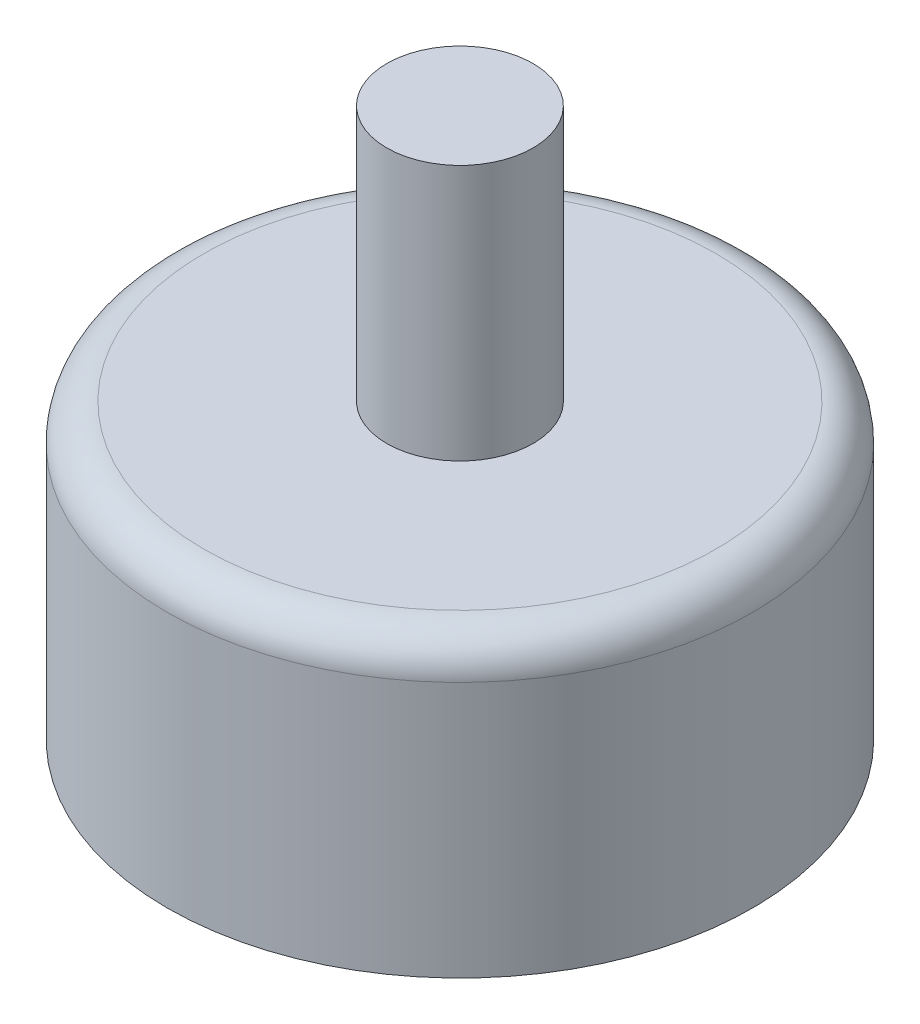
ISO-10303-21;
HEADER;
FILE_DESCRIPTION(('STEP AP214'),'2;1');
FILE_NAME('part.step','',(''),(''),'','','');
FILE_SCHEMA(('AUTOMOTIVE_DESIGN { 1 0 10303 214 1 1 1 1 }'));
ENDSEC;
DATA;
#1=APPLICATION_CONTEXT('core data for automotive mechanical design processes');
#2=APPLICATION_PROTOCOL_DEFINITION('international standard','automotive_design',2000,#1);
#3=PRODUCT_CONTEXT('',#1,'mechanical');
#4=PRODUCT('Part','Part','',(#3));
#5=PRODUCT_RELATED_PRODUCT_CATEGORY('part','',(#4));
#6=PRODUCT_DEFINITION_FORMATION('','',#4);
#7=PRODUCT_DEFINITION_CONTEXT('part definition',#1,'design');
#8=PRODUCT_DEFINITION('design','',#6,#7);
#9=PRODUCT_DEFINITION_SHAPE('','',#8);
#10=(LENGTH_UNIT() NAMED_UNIT(*) SI_UNIT(.MILLI.,.METRE.));
#11=(NAMED_UNIT(*) PLANE_ANGLE_UNIT() SI_UNIT($,.RADIAN.));
#12=(NAMED_UNIT(*) SI_UNIT($,.STERADIAN.) SOLID_ANGLE_UNIT());
#13=UNCERTAINTY_MEASURE_WITH_UNIT(LENGTH_MEASURE(1.E-05),#10,'distance_accuracy_value','');
#14=(GEOMETRIC_REPRESENTATION_CONTEXT(3) GLOBAL_UNCERTAINTY_ASSIGNED_CONTEXT((#13)) GLOBAL_UNIT_ASSIGNED_CONTEXT((#10,
#11,#12)) REPRESENTATION_CONTEXT('',''));
#15=CARTESIAN_POINT('',(0.,0.,0.));
#16=DIRECTION('',(0.,0.,1.));
#17=DIRECTION('',(1.,0.,0.));
#18=AXIS2_PLACEMENT_3D('',#15,#16,#17);
#19=CARTESIAN_POINT('',(0.,20.,0.));
#20=DIRECTION('',(0.,-1.,0.));
#21=DIRECTION('',(0.,0.,-1.));
#22=AXIS2_PLACEMENT_3D('',#19,#20,#21);
#23=CYLINDRICAL_SURFACE('',#22,20.);
#24=CARTESIAN_POINT('',(0.,17.5,0.));
#25=DIRECTION('',(0.,1.,0.));
#26=DIRECTION('',(0.,0.,1.));
#27=AXIS2_PLACEMENT_3D('',#24,#25,#26);
#28=CIRCLE('',#27,20.);
#29=CARTESIAN_POINT('',(0.,17.5,20.));
#30=VERTEX_POINT('',#29);
#31=EDGE_CURVE('E10',#30,#30,#28,.F.);
#32=ORIENTED_EDGE('',*,*,#31,.T.);
#33=EDGE_LOOP('',(#32));
#34=FACE_BOUND('',#33,.T.);
#35=CARTESIAN_POINT('',(0.,0.,0.));
#36=DIRECTION('',(0.,1.,0.));
#37=DIRECTION('',(0.,0.,1.));
#38=AXIS2_PLACEMENT_3D('',#35,#36,#37);
#39=CIRCLE('',#38,20.);
#40=CARTESIAN_POINT('',(0.,0.,20.));
#41=VERTEX_POINT('',#40);
#42=EDGE_CURVE('E51',#41,#41,#39,.T.);
#43=ORIENTED_EDGE('',*,*,#42,.T.);
#44=EDGE_LOOP('',(#43));
#45=FACE_BOUND('',#44,.T.);
#46=ADVANCED_FACE('F36',(#34,#45),#23,.T.);
#47=CARTESIAN_POINT('',(0.,20.,0.));
#48=DIRECTION('',(0.,1.,0.));
#49=DIRECTION('',(0.,0.,1.));
#50=AXIS2_PLACEMENT_3D('',#47,#48,#49);
#51=PLANE('',#50);
#52=CARTESIAN_POINT('',(0.,20.,0.));
#53=DIRECTION('',(0.,1.,0.));
#54=DIRECTION('',(0.,0.,1.));
#55=AXIS2_PLACEMENT_3D('',#52,#53,#54);
#56=CIRCLE('',#55,17.5);
#57=CARTESIAN_POINT('',(0.,20.,17.5));
#58=VERTEX_POINT('',#57);
#59=EDGE_CURVE('E43',#58,#58,#56,.T.);
#60=ORIENTED_EDGE('',*,*,#59,.T.);
#61=EDGE_LOOP('',(#60));
#62=FACE_BOUND('',#61,.T.);
#63=CARTESIAN_POINT('',(0.,20.,0.));
#64=DIRECTION('',(0.,1.,0.));
#65=DIRECTION('',(0.,0.,1.));
#66=AXIS2_PLACEMENT_3D('',#63,#64,#65);
#67=CIRCLE('',#66,5.);
#68=CARTESIAN_POINT('',(0.,20.,5.));
#69=VERTEX_POINT('',#68);
#70=EDGE_CURVE('E47',#69,#69,#67,.T.);
#71=ORIENTED_EDGE('',*,*,#70,.F.);
#72=EDGE_LOOP('',(#71));
#73=FACE_BOUND('',#72,.T.);
#74=ADVANCED_FACE('F69',(#62,#73),#51,.T.);
#75=CARTESIAN_POINT('',(0.,0.,0.));
#76=DIRECTION('',(0.,1.,0.));
#77=DIRECTION('',(0.,0.,1.));
#78=AXIS2_PLACEMENT_3D('',#75,#76,#77);
#79=PLANE('',#78);
#80=ORIENTED_EDGE('',*,*,#42,.F.);
#81=EDGE_LOOP('',(#80));
#82=FACE_BOUND('',#81,.T.);
#83=ADVANCED_FACE('F65',(#82),#79,.F.);
#84=CARTESIAN_POINT('',(0.,37.5,0.));
#85=DIRECTION('',(0.,-1.,0.));
#86=DIRECTION('',(0.,0.,-1.));
#87=AXIS2_PLACEMENT_3D('',#84,#85,#86);
#88=CYLINDRICAL_SURFACE('',#87,5.);
#89=CARTESIAN_POINT('',(0.,37.5,0.));
#90=DIRECTION('',(0.,1.,0.));
#91=DIRECTION('',(0.,0.,1.));
#92=AXIS2_PLACEMENT_3D('',#89,#90,#91);
#93=CIRCLE('',#92,5.);
#94=CARTESIAN_POINT('',(0.,37.5,5.));
#95=VERTEX_POINT('',#94);
#96=EDGE_CURVE('E55',#95,#95,#93,.T.);
#97=ORIENTED_EDGE('',*,*,#96,.F.);
#98=EDGE_LOOP('',(#97));
#99=FACE_BOUND('',#98,.T.);
#100=ORIENTED_EDGE('',*,*,#70,.T.);
#101=EDGE_LOOP('',(#100));
#102=FACE_BOUND('',#101,.T.);
#103=ADVANCED_FACE('F62',(#99,#102),#88,.T.);
#104=CARTESIAN_POINT('',(0.,37.5,0.));
#105=DIRECTION('',(0.,1.,0.));
#106=DIRECTION('',(0.,0.,1.));
#107=AXIS2_PLACEMENT_3D('',#104,#105,#106);
#108=PLANE('',#107);
#109=ORIENTED_EDGE('',*,*,#96,.T.);
#110=EDGE_LOOP('',(#109));
#111=FACE_BOUND('',#110,.T.);
#112=ADVANCED_FACE('F60',(#111),#108,.T.);
#113=CARTESIAN_POINT('',(0.,17.5,0.));
#114=DIRECTION('',(0.,1.,0.));
#115=DIRECTION('',(0.,0.,1.));
#116=AXIS2_PLACEMENT_3D('',#113,#114,#115);
#117=TOROIDAL_SURFACE('',#116,17.5,2.5);
#118=ORIENTED_EDGE('',*,*,#31,.F.);
#119=EDGE_LOOP('',(#118));
#120=FACE_BOUND('',#119,.T.);
#121=ORIENTED_EDGE('',*,*,#59,.F.);
#122=EDGE_LOOP('',(#121));
#123=FACE_BOUND('',#122,.T.);
#124=ADVANCED_FACE('F38',(#120,#123),#117,.T.);
#125=CLOSED_SHELL('',(#46,#74,#83,#103,#112,#124));
#126=MANIFOLD_SOLID_BREP('B2',#125);
#127=ADVANCED_BREP_SHAPE_REPRESENTATION('',(#18,#126),#14);
#128=SHAPE_DEFINITION_REPRESENTATION(#9,#127);
ENDSEC;
END-ISO-10303-21;
